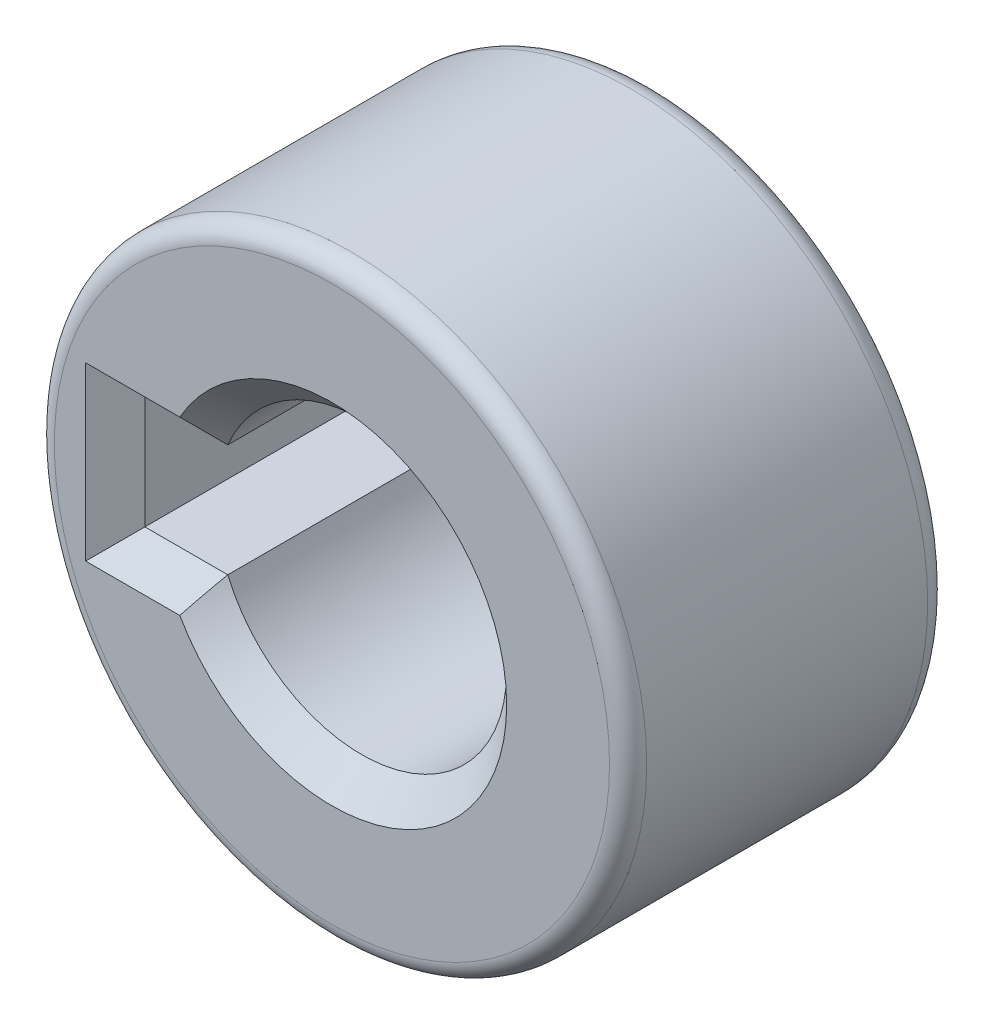
ISO-10303-21;
HEADER;
FILE_DESCRIPTION(('STEP AP214'),'2;1');
FILE_NAME('part.step','',(''),(''),'','','');
FILE_SCHEMA(('AUTOMOTIVE_DESIGN { 1 0 10303 214 1 1 1 1 }'));
ENDSEC;
DATA;
#1=APPLICATION_CONTEXT('core data for automotive mechanical design processes');
#2=APPLICATION_PROTOCOL_DEFINITION('international standard','automotive_design',2000,#1);
#3=PRODUCT_CONTEXT('',#1,'mechanical');
#4=PRODUCT('Part','Part','',(#3));
#5=PRODUCT_RELATED_PRODUCT_CATEGORY('part','',(#4));
#6=PRODUCT_DEFINITION_FORMATION('','',#4);
#7=PRODUCT_DEFINITION_CONTEXT('part definition',#1,'design');
#8=PRODUCT_DEFINITION('design','',#6,#7);
#9=PRODUCT_DEFINITION_SHAPE('','',#8);
#10=(LENGTH_UNIT() NAMED_UNIT(*) SI_UNIT(.MILLI.,.METRE.));
#11=(NAMED_UNIT(*) PLANE_ANGLE_UNIT() SI_UNIT($,.RADIAN.));
#12=(NAMED_UNIT(*) SI_UNIT($,.STERADIAN.) SOLID_ANGLE_UNIT());
#13=UNCERTAINTY_MEASURE_WITH_UNIT(LENGTH_MEASURE(1.E-05),#10,'distance_accuracy_value','');
#14=(GEOMETRIC_REPRESENTATION_CONTEXT(3) GLOBAL_UNCERTAINTY_ASSIGNED_CONTEXT((#13)) GLOBAL_UNIT_ASSIGNED_CONTEXT((#10,
#11,#12)) REPRESENTATION_CONTEXT('',''));
#15=CARTESIAN_POINT('',(0.,0.,0.));
#16=DIRECTION('',(0.,0.,1.));
#17=DIRECTION('',(1.,0.,0.));
#18=AXIS2_PLACEMENT_3D('',#15,#16,#17);
#19=CARTESIAN_POINT('',(0.0861902558427718,0.,8.85601199299395));
#20=DIRECTION('',(0.,0.,1.));
#21=DIRECTION('',(1.,0.,0.));
#22=AXIS2_PLACEMENT_3D('',#19,#20,#21);
#23=PLANE('',#22);
#24=CARTESIAN_POINT('',(0.0861902558427718,0.,8.85601199299395));
#25=DIRECTION('',(0.,0.,1.));
#26=DIRECTION('',(1.,0.,0.));
#27=AXIS2_PLACEMENT_3D('',#24,#25,#26);
#28=CIRCLE('',#27,5.975);
#29=CARTESIAN_POINT('',(6.06119025584277,0.,8.85601199299395));
#30=VERTEX_POINT('',#29);
#31=EDGE_CURVE('E212',#30,#30,#28,.T.);
#32=ORIENTED_EDGE('',*,*,#31,.T.);
#33=EDGE_LOOP('',(#32));
#34=FACE_BOUND('',#33,.T.);
#35=CARTESIAN_POINT('',(0.0861902558427718,0.,8.85601199299395));
#36=DIRECTION('',(0.,0.,1.));
#37=DIRECTION('',(1.,0.,0.));
#38=AXIS2_PLACEMENT_3D('',#35,#36,#37);
#39=CIRCLE('',#38,3.76125);
#40=CARTESIAN_POINT('',(-3.18934405171684,1.84875,8.85601199299395));
#41=VERTEX_POINT('',#40);
#42=CARTESIAN_POINT('',(-3.18934405171684,-1.84875,8.85601199299395));
#43=VERTEX_POINT('',#42);
#44=EDGE_CURVE('E192',#41,#43,#39,.F.);
#45=ORIENTED_EDGE('',*,*,#44,.T.);
#46=DIRECTION('',(-1.,0.,0.));
#47=VECTOR('',#46,1.);
#48=CARTESIAN_POINT('',(-4.57816514076946,-1.84875,8.85601199299395));
#49=LINE('',#48,#47);
#50=CARTESIAN_POINT('',(-5.21566514076946,-1.84875,8.85601199299395));
#51=VERTEX_POINT('',#50);
#52=EDGE_CURVE('E201',#43,#51,#49,.T.);
#53=ORIENTED_EDGE('',*,*,#52,.T.);
#54=DIRECTION('',(0.,1.,0.));
#55=VECTOR('',#54,1.);
#56=CARTESIAN_POINT('',(-5.21566514076946,1.21125,8.85601199299395));
#57=LINE('',#56,#55);
#58=CARTESIAN_POINT('',(-5.21566514076946,1.84875,8.85601199299395));
#59=VERTEX_POINT('',#58);
#60=EDGE_CURVE('E198',#51,#59,#57,.T.);
#61=ORIENTED_EDGE('',*,*,#60,.T.);
#62=DIRECTION('',(1.,0.,0.));
#63=VECTOR('',#62,1.);
#64=CARTESIAN_POINT('',(0.0861902558427718,1.84875,8.85601199299395));
#65=LINE('',#64,#63);
#66=EDGE_CURVE('E195',#59,#41,#65,.T.);
#67=ORIENTED_EDGE('',*,*,#66,.T.);
#68=EDGE_LOOP('',(#45,#53,#61,#67));
#69=FACE_BOUND('',#68,.T.);
#70=ADVANCED_FACE('F97',(#34,#69),#23,.T.);
#71=CARTESIAN_POINT('',(0.0861902558427718,0.,8.85601199299395));
#72=DIRECTION('',(0.,0.,-1.));
#73=DIRECTION('',(-1.,0.,0.));
#74=AXIS2_PLACEMENT_3D('',#71,#72,#73);
#75=CYLINDRICAL_SURFACE('',#74,6.375);
#76=CARTESIAN_POINT('',(0.0861902558427718,0.,2.40726199299395));
#77=DIRECTION('',(0.,0.,1.));
#78=DIRECTION('',(1.,0.,0.));
#79=AXIS2_PLACEMENT_3D('',#76,#77,#78);
#80=CIRCLE('',#79,6.375);
#81=CARTESIAN_POINT('',(6.46119025584277,0.,2.40726199299395));
#82=VERTEX_POINT('',#81);
#83=EDGE_CURVE('E106',#82,#82,#80,.T.);
#84=ORIENTED_EDGE('',*,*,#83,.T.);
#85=EDGE_LOOP('',(#84));
#86=FACE_BOUND('',#85,.T.);
#87=CARTESIAN_POINT('',(0.0861902558427718,0.,8.45601199299395));
#88=DIRECTION('',(0.,0.,1.));
#89=DIRECTION('',(1.,0.,0.));
#90=AXIS2_PLACEMENT_3D('',#87,#88,#89);
#91=CIRCLE('',#90,6.375);
#92=CARTESIAN_POINT('',(6.46119025584277,0.,8.45601199299395));
#93=VERTEX_POINT('',#92);
#94=EDGE_CURVE('E255',#93,#93,#91,.F.);
#95=ORIENTED_EDGE('',*,*,#94,.T.);
#96=EDGE_LOOP('',(#95));
#97=FACE_BOUND('',#96,.T.);
#98=ADVANCED_FACE('F262',(#86,#97),#75,.T.);
#99=CARTESIAN_POINT('',(0.0861902558427718,0.,1.90726199299395));
#100=DIRECTION('',(0.,0.,1.));
#101=DIRECTION('',(1.,0.,0.));
#102=AXIS2_PLACEMENT_3D('',#99,#100,#101);
#103=PLANE('',#102);
#104=CARTESIAN_POINT('',(0.0861902558427718,0.,1.90726199299395));
#105=DIRECTION('',(0.,0.,1.));
#106=DIRECTION('',(1.,0.,0.));
#107=AXIS2_PLACEMENT_3D('',#104,#105,#106);
#108=CIRCLE('',#107,5.875);
#109=CARTESIAN_POINT('',(5.96119025584277,0.,1.90726199299395));
#110=VERTEX_POINT('',#109);
#111=EDGE_CURVE('E13',#110,#110,#108,.F.);
#112=ORIENTED_EDGE('',*,*,#111,.T.);
#113=EDGE_LOOP('',(#112));
#114=FACE_BOUND('',#113,.T.);
#115=ADVANCED_FACE('F279',(#114),#103,.F.);
#116=CARTESIAN_POINT('',(-4.57816514076946,-1.21125,2.48101199299395));
#117=DIRECTION('',(0.,-1.,0.));
#118=DIRECTION('',(0.,0.,-1.));
#119=AXIS2_PLACEMENT_3D('',#116,#117,#118);
#120=PLANE('',#119);
#121=DIRECTION('',(0.,0.,1.));
#122=VECTOR('',#121,1.);
#123=CARTESIAN_POINT('',(-4.57816514076946,-1.21125,2.48101199299395));
#124=LINE('',#123,#122);
#125=CARTESIAN_POINT('',(-4.57816514076946,-1.21125,2.48101199299395));
#126=VERTEX_POINT('',#125);
#127=CARTESIAN_POINT('',(-4.57816514076946,-1.21125,8.21851199299395));
#128=VERTEX_POINT('',#127);
#129=EDGE_CURVE('E159',#126,#128,#124,.T.);
#130=ORIENTED_EDGE('',*,*,#129,.T.);
#131=DIRECTION('',(1.,0.,0.));
#132=VECTOR('',#131,1.);
#133=CARTESIAN_POINT('',(-2.79316514076946,-1.21125,8.21851199299395));
#134=LINE('',#133,#132);
#135=CARTESIAN_POINT('',(-2.79316514076946,-1.21125,8.21851199299395));
#136=VERTEX_POINT('',#135);
#137=EDGE_CURVE('E188',#128,#136,#134,.T.);
#138=ORIENTED_EDGE('',*,*,#137,.T.);
#139=DIRECTION('',(0.,0.,-1.));
#140=VECTOR('',#139,1.);
#141=CARTESIAN_POINT('',(-2.79316514076946,-1.21125,15.231011992994));
#142=LINE('',#141,#140);
#143=CARTESIAN_POINT('',(-2.79316514076946,-1.21125,2.48101199299395));
#144=VERTEX_POINT('',#143);
#145=EDGE_CURVE('E185',#136,#144,#142,.T.);
#146=ORIENTED_EDGE('',*,*,#145,.T.);
#147=DIRECTION('',(1.,0.,0.));
#148=VECTOR('',#147,1.);
#149=CARTESIAN_POINT('',(-4.57816514076946,-1.21125,2.48101199299395));
#150=LINE('',#149,#148);
#151=EDGE_CURVE('E169',#126,#144,#150,.T.);
#152=ORIENTED_EDGE('',*,*,#151,.F.);
#153=EDGE_LOOP('',(#130,#138,#146,#152));
#154=FACE_BOUND('',#153,.T.);
#155=ADVANCED_FACE('F284',(#154),#120,.F.);
#156=CARTESIAN_POINT('',(-4.57816514076946,1.21125,2.48101199299395));
#157=DIRECTION('',(0.,-1.,0.));
#158=DIRECTION('',(0.,0.,-1.));
#159=AXIS2_PLACEMENT_3D('',#156,#157,#158);
#160=PLANE('',#159);
#161=DIRECTION('',(0.,0.,-1.));
#162=VECTOR('',#161,1.);
#163=CARTESIAN_POINT('',(-2.79316514076946,1.21125,15.231011992994));
#164=LINE('',#163,#162);
#165=CARTESIAN_POINT('',(-2.79316514076946,1.21125,8.21851199299395));
#166=VERTEX_POINT('',#165);
#167=CARTESIAN_POINT('',(-2.79316514076946,1.21125,2.48101199299395));
#168=VERTEX_POINT('',#167);
#169=EDGE_CURVE('E182',#166,#168,#164,.T.);
#170=ORIENTED_EDGE('',*,*,#169,.F.);
#171=DIRECTION('',(-1.,0.,0.));
#172=VECTOR('',#171,1.);
#173=CARTESIAN_POINT('',(-4.57816514076946,1.21125,8.21851199299395));
#174=LINE('',#173,#172);
#175=CARTESIAN_POINT('',(-4.57816514076946,1.21125,8.21851199299395));
#176=VERTEX_POINT('',#175);
#177=EDGE_CURVE('E120',#166,#176,#174,.T.);
#178=ORIENTED_EDGE('',*,*,#177,.T.);
#179=DIRECTION('',(0.,0.,1.));
#180=VECTOR('',#179,1.);
#181=CARTESIAN_POINT('',(-4.57816514076946,1.21125,2.48101199299395));
#182=LINE('',#181,#180);
#183=CARTESIAN_POINT('',(-4.57816514076946,1.21125,2.48101199299395));
#184=VERTEX_POINT('',#183);
#185=EDGE_CURVE('E150',#184,#176,#182,.T.);
#186=ORIENTED_EDGE('',*,*,#185,.F.);
#187=DIRECTION('',(1.,0.,0.));
#188=VECTOR('',#187,1.);
#189=CARTESIAN_POINT('',(-4.57816514076946,1.21125,2.48101199299395));
#190=LINE('',#189,#188);
#191=EDGE_CURVE('E153',#184,#168,#190,.T.);
#192=ORIENTED_EDGE('',*,*,#191,.T.);
#193=EDGE_LOOP('',(#170,#178,#186,#192));
#194=FACE_BOUND('',#193,.T.);
#195=ADVANCED_FACE('F152',(#194),#160,.T.);
#196=CARTESIAN_POINT('',(0.0861902558427718,0.,2.48101199299395));
#197=DIRECTION('',(0.,0.,1.));
#198=DIRECTION('',(1.,0.,0.));
#199=AXIS2_PLACEMENT_3D('',#196,#197,#198);
#200=PLANE('',#199);
#201=CARTESIAN_POINT('',(0.0861902558427718,0.,2.48101199299395));
#202=DIRECTION('',(0.,0.,1.));
#203=DIRECTION('',(1.,0.,0.));
#204=AXIS2_PLACEMENT_3D('',#201,#202,#203);
#205=CIRCLE('',#204,3.12375);
#206=EDGE_CURVE('E167',#144,#168,#205,.T.);
#207=ORIENTED_EDGE('',*,*,#206,.T.);
#208=ORIENTED_EDGE('',*,*,#191,.F.);
#209=DIRECTION('',(0.,-1.,0.));
#210=VECTOR('',#209,1.);
#211=CARTESIAN_POINT('',(-4.57816514076946,1.21125,2.48101199299395));
#212=LINE('',#211,#210);
#213=EDGE_CURVE('E160',#184,#126,#212,.T.);
#214=ORIENTED_EDGE('',*,*,#213,.T.);
#215=ORIENTED_EDGE('',*,*,#151,.T.);
#216=EDGE_LOOP('',(#207,#208,#214,#215));
#217=FACE_BOUND('',#216,.T.);
#218=ADVANCED_FACE('F164',(#217),#200,.T.);
#219=CARTESIAN_POINT('',(-4.57816514076946,1.21125,2.48101199299395));
#220=DIRECTION('',(-1.,0.,0.));
#221=DIRECTION('',(0.,0.,1.));
#222=AXIS2_PLACEMENT_3D('',#219,#220,#221);
#223=PLANE('',#222);
#224=ORIENTED_EDGE('',*,*,#185,.T.);
#225=DIRECTION('',(0.,-1.,0.));
#226=VECTOR('',#225,1.);
#227=CARTESIAN_POINT('',(-4.57816514076946,-1.21125,8.21851199299395));
#228=LINE('',#227,#226);
#229=EDGE_CURVE('E205',#176,#128,#228,.T.);
#230=ORIENTED_EDGE('',*,*,#229,.T.);
#231=ORIENTED_EDGE('',*,*,#129,.F.);
#232=ORIENTED_EDGE('',*,*,#213,.F.);
#233=EDGE_LOOP('',(#224,#230,#231,#232));
#234=FACE_BOUND('',#233,.T.);
#235=ADVANCED_FACE('F171',(#234),#223,.F.);
#236=CARTESIAN_POINT('',(0.0861902558427718,0.,15.231011992994));
#237=DIRECTION('',(0.,0.,-1.));
#238=DIRECTION('',(-1.,0.,0.));
#239=AXIS2_PLACEMENT_3D('',#236,#237,#238);
#240=CYLINDRICAL_SURFACE('',#239,3.12375);
#241=ORIENTED_EDGE('',*,*,#145,.F.);
#242=CARTESIAN_POINT('',(0.0861902558427718,0.,8.21851199299395));
#243=DIRECTION('',(0.,0.,1.));
#244=DIRECTION('',(1.,0.,0.));
#245=AXIS2_PLACEMENT_3D('',#242,#243,#244);
#246=CIRCLE('',#245,3.12375);
#247=EDGE_CURVE('E113',#136,#166,#246,.T.);
#248=ORIENTED_EDGE('',*,*,#247,.T.);
#249=ORIENTED_EDGE('',*,*,#169,.T.);
#250=ORIENTED_EDGE('',*,*,#206,.F.);
#251=EDGE_LOOP('',(#241,#248,#249,#250));
#252=FACE_BOUND('',#251,.T.);
#253=ADVANCED_FACE('F238',(#252),#240,.F.);
#254=CARTESIAN_POINT('',(0.0861902558427718,1.84875,8.85601199299395));
#255=DIRECTION('',(0.,0.707106781186548,-0.707106781186547));
#256=DIRECTION('',(1.,0.,0.));
#257=AXIS2_PLACEMENT_3D('',#254,#255,#256);
#258=PLANE('',#257);
#259=CARTESIAN_POINT('',(-3.18934405171684,1.84875,8.85601199299395));
#260=CARTESIAN_POINT('',(-3.15802135876325,1.79510618592868,8.80236817892263));
#261=CARTESIAN_POINT('',(-3.12631701507225,1.74157321298762,8.74883520598157));
#262=CARTESIAN_POINT('',(-3.06208823372616,1.63476279585704,8.642024788851));
#263=CARTESIAN_POINT('',(-3.02956391183256,1.58148531684789,8.58874730984185));
#264=CARTESIAN_POINT('',(-2.96362857613614,1.47520297256797,8.48246496556192));
#265=CARTESIAN_POINT('',(-2.93021753426479,1.42219811599042,8.42946010898438));
#266=CARTESIAN_POINT('',(-2.8624315957558,1.3164886294438,8.32375062243776));
#267=CARTESIAN_POINT('',(-2.82805656436969,1.26378404269841,8.27104603569236));
#268=CARTESIAN_POINT('',(-2.79316514076946,1.21125,8.21851199299395));
#269=B_SPLINE_CURVE_WITH_KNOTS('',3,(#259,#260,#261,#262,#263,#264,#265,#266,#267,#268),
.UNSPECIFIED.,.F.,.F.,(4,2,2,2,4),(0.,0.246227299491491,0.492420030050408,0.738620562991912,
0.984855683604348),.UNSPECIFIED.);
#270=EDGE_CURVE('E240',#41,#166,#269,.T.);
#271=ORIENTED_EDGE('',*,*,#270,.F.);
#272=ORIENTED_EDGE('',*,*,#66,.F.);
#273=DIRECTION('',(-0.577350269189625,0.577350269189626,0.577350269189627));
#274=VECTOR('',#273,1.);
#275=CARTESIAN_POINT('',(-4.57816514076946,1.21125,8.21851199299395));
#276=LINE('',#275,#274);
#277=EDGE_CURVE('E248',#176,#59,#276,.T.);
#278=ORIENTED_EDGE('',*,*,#277,.F.);
#279=ORIENTED_EDGE('',*,*,#177,.F.);
#280=EDGE_LOOP('',(#271,#272,#278,#279));
#281=FACE_BOUND('',#280,.T.);
#282=ADVANCED_FACE('F233',(#281),#258,.F.);
#283=CARTESIAN_POINT('',(-4.57816514076946,1.21125,8.21851199299395));
#284=DIRECTION('',(0.707106781186548,0.,0.707106781186547));
#285=DIRECTION('',(0.,1.,0.));
#286=AXIS2_PLACEMENT_3D('',#283,#284,#285);
#287=PLANE('',#286);
#288=ORIENTED_EDGE('',*,*,#277,.T.);
#289=ORIENTED_EDGE('',*,*,#60,.F.);
#290=DIRECTION('',(0.577350269189625,0.577350269189626,-0.577350269189627));
#291=VECTOR('',#290,1.);
#292=CARTESIAN_POINT('',(-4.57816514076946,-1.21125,8.21851199299395));
#293=LINE('',#292,#291);
#294=EDGE_CURVE('E222',#128,#51,#293,.F.);
#295=ORIENTED_EDGE('',*,*,#294,.F.);
#296=ORIENTED_EDGE('',*,*,#229,.F.);
#297=EDGE_LOOP('',(#288,#289,#295,#296));
#298=FACE_BOUND('',#297,.T.);
#299=ADVANCED_FACE('F237',(#298),#287,.T.);
#300=CARTESIAN_POINT('',(0.0861902558427718,0.,8.85601199299395));
#301=DIRECTION('',(0.,0.,1.));
#302=DIRECTION('',(1.,0.,0.));
#303=AXIS2_PLACEMENT_3D('',#300,#301,#302);
#304=CONICAL_SURFACE('',#303,3.76125,0.785398163397447);
#305=ORIENTED_EDGE('',*,*,#270,.T.);
#306=ORIENTED_EDGE('',*,*,#247,.F.);
#307=CARTESIAN_POINT('',(-2.79316514076946,-1.21125,8.21851199299395));
#308=CARTESIAN_POINT('',(-2.82805656436969,-1.26378404269841,8.27104603569236));
#309=CARTESIAN_POINT('',(-2.8624315957558,-1.3164886294438,8.32375062243776));
#310=CARTESIAN_POINT('',(-2.93021753426479,-1.42219811599042,8.42946010898438));
#311=CARTESIAN_POINT('',(-2.96362857613614,-1.47520297256796,8.48246496556192));
#312=CARTESIAN_POINT('',(-3.02956391183256,-1.58148531684789,8.58874730984185));
#313=CARTESIAN_POINT('',(-3.06208823372616,-1.63476279585704,8.642024788851));
#314=CARTESIAN_POINT('',(-3.12631701507225,-1.74157321298762,8.74883520598157));
#315=CARTESIAN_POINT('',(-3.15802135876325,-1.79510618592868,8.80236817892263));
#316=CARTESIAN_POINT('',(-3.18934405171683,-1.84875,8.85601199299395));
#317=B_SPLINE_CURVE_WITH_KNOTS('',3,(#307,#308,#309,#310,#311,#312,#313,#314,#315,#316),
.UNSPECIFIED.,.F.,.F.,(4,2,2,2,4),(0.,0.246235120612436,0.492435653553939,0.738628384112856,
0.984855683604348),.UNSPECIFIED.);
#318=EDGE_CURVE('E213',#43,#136,#317,.F.);
#319=ORIENTED_EDGE('',*,*,#318,.F.);
#320=ORIENTED_EDGE('',*,*,#44,.F.);
#321=EDGE_LOOP('',(#305,#306,#319,#320));
#322=FACE_BOUND('',#321,.T.);
#323=ADVANCED_FACE('F224',(#322),#304,.F.);
#324=CARTESIAN_POINT('',(-4.57816514076946,-1.21125,8.21851199299395));
#325=DIRECTION('',(0.,0.707106781186548,0.707106781186547));
#326=DIRECTION('',(-1.,0.,0.));
#327=AXIS2_PLACEMENT_3D('',#324,#325,#326);
#328=PLANE('',#327);
#329=ORIENTED_EDGE('',*,*,#294,.T.);
#330=ORIENTED_EDGE('',*,*,#52,.F.);
#331=ORIENTED_EDGE('',*,*,#318,.T.);
#332=ORIENTED_EDGE('',*,*,#137,.F.);
#333=EDGE_LOOP('',(#329,#330,#331,#332));
#334=FACE_BOUND('',#333,.T.);
#335=ADVANCED_FACE('F227',(#334),#328,.T.);
#336=CARTESIAN_POINT('',(0.0861902558427718,0.,8.45601199299395));
#337=DIRECTION('',(0.,0.,1.));
#338=DIRECTION('',(1.,0.,0.));
#339=AXIS2_PLACEMENT_3D('',#336,#337,#338);
#340=TOROIDAL_SURFACE('',#339,5.975,0.4);
#341=ORIENTED_EDGE('',*,*,#94,.F.);
#342=EDGE_LOOP('',(#341));
#343=FACE_BOUND('',#342,.T.);
#344=ORIENTED_EDGE('',*,*,#31,.F.);
#345=EDGE_LOOP('',(#344));
#346=FACE_BOUND('',#345,.T.);
#347=ADVANCED_FACE('F231',(#343,#346),#340,.T.);
#348=CARTESIAN_POINT('',(0.0861902558427718,0.,2.40726199299395));
#349=DIRECTION('',(0.,0.,1.));
#350=DIRECTION('',(1.,0.,0.));
#351=AXIS2_PLACEMENT_3D('',#348,#349,#350);
#352=TOROIDAL_SURFACE('',#351,5.875,0.5);
#353=ORIENTED_EDGE('',*,*,#111,.F.);
#354=EDGE_LOOP('',(#353));
#355=FACE_BOUND('',#354,.T.);
#356=ORIENTED_EDGE('',*,*,#83,.F.);
#357=EDGE_LOOP('',(#356));
#358=FACE_BOUND('',#357,.T.);
#359=ADVANCED_FACE('F99',(#355,#358),#352,.T.);
#360=CLOSED_SHELL('',(#70,#98,#115,#155,#195,#218,#235,#253,#282,#299,#323,#335,#347,#359));
#361=MANIFOLD_SOLID_BREP('B2',#360);
#362=ADVANCED_BREP_SHAPE_REPRESENTATION('',(#18,#361),#14);
#363=SHAPE_DEFINITION_REPRESENTATION(#9,#362);
ENDSEC;
END-ISO-10303-21;
